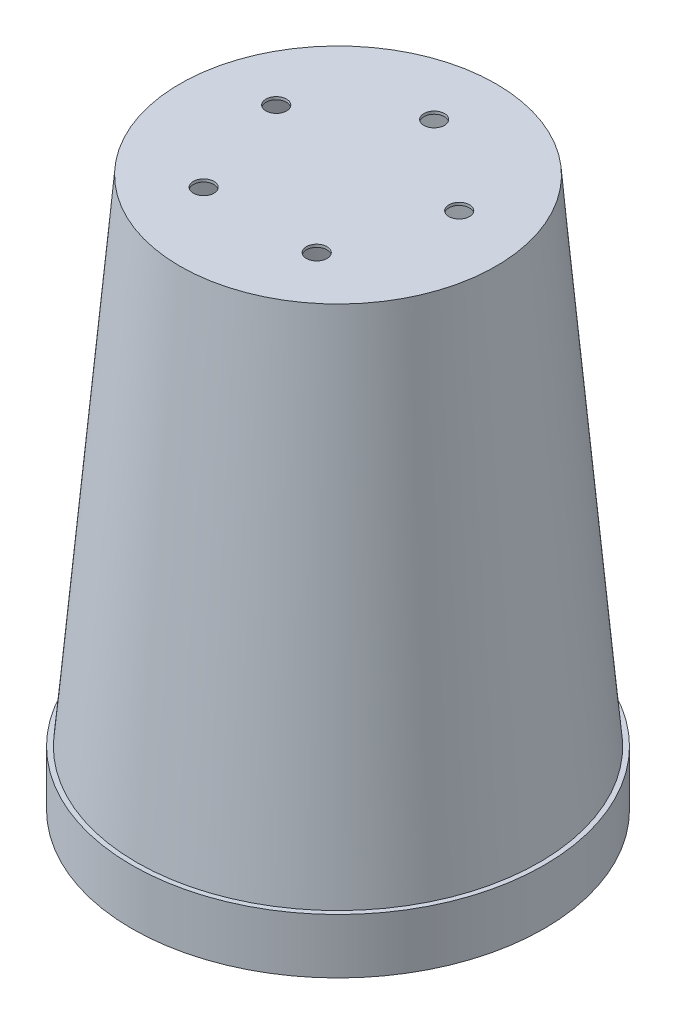
ISO-10303-21;
HEADER;
FILE_DESCRIPTION(('STEP AP214'),'2;1');
FILE_NAME('part.step','',(''),(''),'','','');
FILE_SCHEMA(('AUTOMOTIVE_DESIGN { 1 0 10303 214 1 1 1 1 }'));
ENDSEC;
DATA;
#1=APPLICATION_CONTEXT('core data for automotive mechanical design processes');
#2=APPLICATION_PROTOCOL_DEFINITION('international standard','automotive_design',2000,#1);
#3=PRODUCT_CONTEXT('',#1,'mechanical');
#4=PRODUCT('Part','Part','',(#3));
#5=PRODUCT_RELATED_PRODUCT_CATEGORY('part','',(#4));
#6=PRODUCT_DEFINITION_FORMATION('','',#4);
#7=PRODUCT_DEFINITION_CONTEXT('part definition',#1,'design');
#8=PRODUCT_DEFINITION('design','',#6,#7);
#9=PRODUCT_DEFINITION_SHAPE('','',#8);
#10=(LENGTH_UNIT() NAMED_UNIT(*) SI_UNIT(.MILLI.,.METRE.));
#11=(NAMED_UNIT(*) PLANE_ANGLE_UNIT() SI_UNIT($,.RADIAN.));
#12=(NAMED_UNIT(*) SI_UNIT($,.STERADIAN.) SOLID_ANGLE_UNIT());
#13=UNCERTAINTY_MEASURE_WITH_UNIT(LENGTH_MEASURE(1.E-05),#10,'distance_accuracy_value','');
#14=(GEOMETRIC_REPRESENTATION_CONTEXT(3) GLOBAL_UNCERTAINTY_ASSIGNED_CONTEXT((#13)) GLOBAL_UNIT_ASSIGNED_CONTEXT((#10,
#11,#12)) REPRESENTATION_CONTEXT('',''));
#15=CARTESIAN_POINT('',(0.,0.,0.));
#16=DIRECTION('',(0.,0.,1.));
#17=DIRECTION('',(1.,0.,0.));
#18=AXIS2_PLACEMENT_3D('',#15,#16,#17);
#19=CARTESIAN_POINT('',(0.,0.,0.));
#20=DIRECTION('',(0.,-1.,0.));
#21=DIRECTION('',(0.,0.,1.));
#22=AXIS2_PLACEMENT_3D('',#19,#20,#21);
#23=CONICAL_SURFACE('',#22,75.,0.0872664625997167);
#24=CARTESIAN_POINT('',(0.,20.,0.));
#25=DIRECTION('',(0.,1.,0.));
#26=DIRECTION('',(0.,0.,1.));
#27=AXIS2_PLACEMENT_3D('',#24,#25,#26);
#28=CIRCLE('',#27,73.2502267294815);
#29=CARTESIAN_POINT('',(0.,20.,73.2502267294815));
#30=VERTEX_POINT('',#29);
#31=EDGE_CURVE('E34',#30,#30,#28,.T.);
#32=ORIENTED_EDGE('',*,*,#31,.T.);
#33=EDGE_LOOP('',(#32));
#34=FACE_BOUND('',#33,.T.);
#35=CARTESIAN_POINT('',(0.,200.,0.));
#36=DIRECTION('',(0.,1.,0.));
#37=DIRECTION('',(0.,0.,1.));
#38=AXIS2_PLACEMENT_3D('',#35,#36,#37);
#39=CIRCLE('',#38,57.5022672948152);
#40=CARTESIAN_POINT('',(0.,200.,57.5022672948152));
#41=VERTEX_POINT('',#40);
#42=EDGE_CURVE('E10',#41,#41,#39,.T.);
#43=ORIENTED_EDGE('',*,*,#42,.F.);
#44=EDGE_LOOP('',(#43));
#45=FACE_BOUND('',#44,.T.);
#46=ADVANCED_FACE('F31',(#34,#45),#23,.T.);
#47=CARTESIAN_POINT('',(0.,200.,0.));
#48=DIRECTION('',(0.,1.,0.));
#49=DIRECTION('',(0.,0.,1.));
#50=AXIS2_PLACEMENT_3D('',#47,#48,#49);
#51=PLANE('',#50);
#52=CARTESIAN_POINT('',(-20.5724838302364,200.,28.3155948031233));
#53=DIRECTION('',(0.,1.,0.));
#54=DIRECTION('',(0.587785252292469,0.,-0.809016994374951));
#55=AXIS2_PLACEMENT_3D('',#52,#53,#54);
#56=CIRCLE('',#55,3.75);
#57=CARTESIAN_POINT('',(-20.5724838302364,200.,32.0655948031233));
#58=VERTEX_POINT('',#57);
#59=EDGE_CURVE('E82',#58,#58,#56,.T.);
#60=ORIENTED_EDGE('',*,*,#59,.F.);
#61=EDGE_LOOP('',(#60));
#62=FACE_BOUND('',#61,.T.);
#63=CARTESIAN_POINT('',(20.5724838302368,200.,28.315594803123));
#64=DIRECTION('',(0.,1.,0.));
#65=DIRECTION('',(-0.58778525229248,0.,-0.809016994374942));
#66=AXIS2_PLACEMENT_3D('',#63,#64,#65);
#67=CIRCLE('',#66,3.75);
#68=CARTESIAN_POINT('',(20.5724838302368,200.,32.065594803123));
#69=VERTEX_POINT('',#68);
#70=EDGE_CURVE('E75',#69,#69,#67,.T.);
#71=ORIENTED_EDGE('',*,*,#70,.F.);
#72=EDGE_LOOP('',(#71));
#73=FACE_BOUND('',#72,.T.);
#74=CARTESIAN_POINT('',(33.2869780703303,200.,-10.8155948031235));
#75=DIRECTION('',(0.,1.,0.));
#76=DIRECTION('',(-0.95105651629515,0.,0.309016994374958));
#77=AXIS2_PLACEMENT_3D('',#74,#75,#76);
#78=CIRCLE('',#77,3.75);
#79=CARTESIAN_POINT('',(33.2869780703303,200.,-7.06559480312354));
#80=VERTEX_POINT('',#79);
#81=EDGE_CURVE('E76',#80,#80,#78,.T.);
#82=ORIENTED_EDGE('',*,*,#81,.F.);
#83=EDGE_LOOP('',(#82));
#84=FACE_BOUND('',#83,.T.);
#85=CARTESIAN_POINT('',(-33.2869780703304,200.,-10.8155948031231));
#86=DIRECTION('',(0.,1.,0.));
#87=DIRECTION('',(0.951056516295155,0.,0.309016994374945));
#88=AXIS2_PLACEMENT_3D('',#85,#86,#87);
#89=CIRCLE('',#88,3.75);
#90=CARTESIAN_POINT('',(-33.2869780703304,200.,-7.06559480312307));
#91=VERTEX_POINT('',#90);
#92=EDGE_CURVE('E68',#91,#91,#89,.T.);
#93=ORIENTED_EDGE('',*,*,#92,.F.);
#94=EDGE_LOOP('',(#93));
#95=FACE_BOUND('',#94,.T.);
#96=CARTESIAN_POINT('',(0.,200.,-35.));
#97=DIRECTION('',(0.,1.,0.));
#98=DIRECTION('',(0.,0.,1.));
#99=AXIS2_PLACEMENT_3D('',#96,#97,#98);
#100=CIRCLE('',#99,3.75);
#101=CARTESIAN_POINT('',(0.,200.,-31.25));
#102=VERTEX_POINT('',#101);
#103=EDGE_CURVE('E62',#102,#102,#100,.T.);
#104=ORIENTED_EDGE('',*,*,#103,.F.);
#105=EDGE_LOOP('',(#104));
#106=FACE_BOUND('',#105,.T.);
#107=ORIENTED_EDGE('',*,*,#42,.T.);
#108=EDGE_LOOP('',(#107));
#109=FACE_BOUND('',#108,.T.);
#110=ADVANCED_FACE('F93',(#62,#73,#84,#95,#106,#109),#51,.T.);
#111=CARTESIAN_POINT('',(0.,20.,0.));
#112=DIRECTION('',(0.,-1.,0.));
#113=DIRECTION('',(0.,0.,-1.));
#114=AXIS2_PLACEMENT_3D('',#111,#112,#113);
#115=CYLINDRICAL_SURFACE('',#114,75.);
#116=CARTESIAN_POINT('',(0.,20.,0.));
#117=DIRECTION('',(0.,1.,0.));
#118=DIRECTION('',(0.,0.,1.));
#119=AXIS2_PLACEMENT_3D('',#116,#117,#118);
#120=CIRCLE('',#119,75.);
#121=CARTESIAN_POINT('',(0.,20.,75.));
#122=VERTEX_POINT('',#121);
#123=EDGE_CURVE('E44',#122,#122,#120,.T.);
#124=ORIENTED_EDGE('',*,*,#123,.F.);
#125=EDGE_LOOP('',(#124));
#126=FACE_BOUND('',#125,.T.);
#127=CARTESIAN_POINT('',(0.,0.,0.));
#128=DIRECTION('',(0.,1.,0.));
#129=DIRECTION('',(0.,0.,1.));
#130=AXIS2_PLACEMENT_3D('',#127,#128,#129);
#131=CIRCLE('',#130,75.);
#132=CARTESIAN_POINT('',(0.,0.,75.));
#133=VERTEX_POINT('',#132);
#134=EDGE_CURVE('E38',#133,#133,#131,.T.);
#135=ORIENTED_EDGE('',*,*,#134,.T.);
#136=EDGE_LOOP('',(#135));
#137=FACE_BOUND('',#136,.T.);
#138=ADVANCED_FACE('F96',(#126,#137),#115,.T.);
#139=CARTESIAN_POINT('',(0.,20.,0.));
#140=DIRECTION('',(0.,1.,0.));
#141=DIRECTION('',(0.,0.,1.));
#142=AXIS2_PLACEMENT_3D('',#139,#140,#141);
#143=PLANE('',#142);
#144=ORIENTED_EDGE('',*,*,#31,.F.);
#145=EDGE_LOOP('',(#144));
#146=FACE_BOUND('',#145,.T.);
#147=ORIENTED_EDGE('',*,*,#123,.T.);
#148=EDGE_LOOP('',(#147));
#149=FACE_BOUND('',#148,.T.);
#150=ADVANCED_FACE('F130',(#146,#149),#143,.T.);
#151=CARTESIAN_POINT('',(0.,0.,0.));
#152=DIRECTION('',(0.,1.,0.));
#153=DIRECTION('',(0.,0.,1.));
#154=AXIS2_PLACEMENT_3D('',#151,#152,#153);
#155=PLANE('',#154);
#156=CARTESIAN_POINT('',(0.,0.,0.));
#157=DIRECTION('',(0.,1.,0.));
#158=DIRECTION('',(0.,0.,1.));
#159=AXIS2_PLACEMENT_3D('',#156,#157,#158);
#160=CIRCLE('',#159,74.);
#161=CARTESIAN_POINT('',(0.,0.,74.));
#162=VERTEX_POINT('',#161);
#163=EDGE_CURVE('E48',#162,#162,#160,.T.);
#164=ORIENTED_EDGE('',*,*,#163,.T.);
#165=EDGE_LOOP('',(#164));
#166=FACE_BOUND('',#165,.T.);
#167=ORIENTED_EDGE('',*,*,#134,.F.);
#168=EDGE_LOOP('',(#167));
#169=FACE_BOUND('',#168,.T.);
#170=ADVANCED_FACE('F124',(#166,#169),#155,.F.);
#171=CARTESIAN_POINT('',(0.,-0.0871557427476584,0.));
#172=DIRECTION('',(0.,-1.,0.));
#173=DIRECTION('',(0.,0.,1.));
#174=AXIS2_PLACEMENT_3D('',#171,#172,#173);
#175=CONICAL_SURFACE('',#174,74.0038053019083,0.0872664625997167);
#176=CARTESIAN_POINT('',(0.,19.,0.));
#177=DIRECTION('',(0.,1.,0.));
#178=DIRECTION('',(0.,0.,1.));
#179=AXIS2_PLACEMENT_3D('',#176,#177,#178);
#180=CIRCLE('',#179,72.3338955554641);
#181=CARTESIAN_POINT('',(0.,19.,72.3338955554641));
#182=VERTEX_POINT('',#181);
#183=EDGE_CURVE('E51',#182,#182,#180,.T.);
#184=ORIENTED_EDGE('',*,*,#183,.F.);
#185=EDGE_LOOP('',(#184));
#186=FACE_BOUND('',#185,.T.);
#187=CARTESIAN_POINT('',(0.,199.,0.));
#188=DIRECTION('',(0.,1.,0.));
#189=DIRECTION('',(0.,0.,1.));
#190=AXIS2_PLACEMENT_3D('',#187,#188,#189);
#191=CIRCLE('',#190,56.5859361207977);
#192=CARTESIAN_POINT('',(0.,199.,56.5859361207977));
#193=VERTEX_POINT('',#192);
#194=EDGE_CURVE('E47',#193,#193,#191,.T.);
#195=ORIENTED_EDGE('',*,*,#194,.T.);
#196=EDGE_LOOP('',(#195));
#197=FACE_BOUND('',#196,.T.);
#198=ADVANCED_FACE('F118',(#186,#197),#175,.F.);
#199=CARTESIAN_POINT('',(0.,199.,0.));
#200=DIRECTION('',(0.,1.,0.));
#201=DIRECTION('',(0.,0.,1.));
#202=AXIS2_PLACEMENT_3D('',#199,#200,#201);
#203=PLANE('',#202);
#204=CARTESIAN_POINT('',(-20.5724838302364,199.,28.3155948031233));
#205=DIRECTION('',(0.,1.,0.));
#206=DIRECTION('',(0.,0.,1.));
#207=AXIS2_PLACEMENT_3D('',#204,#205,#206);
#208=CIRCLE('',#207,3.75);
#209=CARTESIAN_POINT('',(-20.5724838302364,199.,32.0655948031233));
#210=VERTEX_POINT('',#209);
#211=EDGE_CURVE('E71',#210,#210,#208,.F.);
#212=ORIENTED_EDGE('',*,*,#211,.F.);
#213=EDGE_LOOP('',(#212));
#214=FACE_BOUND('',#213,.T.);
#215=CARTESIAN_POINT('',(20.5724838302368,199.,28.315594803123));
#216=DIRECTION('',(0.,1.,0.));
#217=DIRECTION('',(0.,0.,1.));
#218=AXIS2_PLACEMENT_3D('',#215,#216,#217);
#219=CIRCLE('',#218,3.75);
#220=CARTESIAN_POINT('',(20.5724838302368,199.,32.065594803123));
#221=VERTEX_POINT('',#220);
#222=EDGE_CURVE('E79',#221,#221,#219,.F.);
#223=ORIENTED_EDGE('',*,*,#222,.F.);
#224=EDGE_LOOP('',(#223));
#225=FACE_BOUND('',#224,.T.);
#226=CARTESIAN_POINT('',(33.2869780703303,199.,-10.8155948031235));
#227=DIRECTION('',(0.,1.,0.));
#228=DIRECTION('',(0.,0.,1.));
#229=AXIS2_PLACEMENT_3D('',#226,#227,#228);
#230=CIRCLE('',#229,3.75);
#231=CARTESIAN_POINT('',(33.2869780703303,199.,-7.06559480312354));
#232=VERTEX_POINT('',#231);
#233=EDGE_CURVE('E72',#232,#232,#230,.F.);
#234=ORIENTED_EDGE('',*,*,#233,.F.);
#235=EDGE_LOOP('',(#234));
#236=FACE_BOUND('',#235,.T.);
#237=CARTESIAN_POINT('',(-33.2869780703304,199.,-10.8155948031231));
#238=DIRECTION('',(0.,1.,0.));
#239=DIRECTION('',(0.,0.,1.));
#240=AXIS2_PLACEMENT_3D('',#237,#238,#239);
#241=CIRCLE('',#240,3.75);
#242=CARTESIAN_POINT('',(-33.2869780703304,199.,-7.06559480312307));
#243=VERTEX_POINT('',#242);
#244=EDGE_CURVE('E65',#243,#243,#241,.F.);
#245=ORIENTED_EDGE('',*,*,#244,.F.);
#246=EDGE_LOOP('',(#245));
#247=FACE_BOUND('',#246,.T.);
#248=CARTESIAN_POINT('',(0.,199.,-35.));
#249=DIRECTION('',(0.,1.,0.));
#250=DIRECTION('',(0.,0.,1.));
#251=AXIS2_PLACEMENT_3D('',#248,#249,#250);
#252=CIRCLE('',#251,3.75);
#253=CARTESIAN_POINT('',(0.,199.,-31.25));
#254=VERTEX_POINT('',#253);
#255=EDGE_CURVE('E55',#254,#254,#252,.F.);
#256=ORIENTED_EDGE('',*,*,#255,.F.);
#257=EDGE_LOOP('',(#256));
#258=FACE_BOUND('',#257,.T.);
#259=ORIENTED_EDGE('',*,*,#194,.F.);
#260=EDGE_LOOP('',(#259));
#261=FACE_BOUND('',#260,.T.);
#262=ADVANCED_FACE('F114',(#214,#225,#236,#247,#258,#261),#203,.F.);
#263=CARTESIAN_POINT('',(0.,20.,0.));
#264=DIRECTION('',(0.,-1.,0.));
#265=DIRECTION('',(0.,0.,-1.));
#266=AXIS2_PLACEMENT_3D('',#263,#264,#265);
#267=CYLINDRICAL_SURFACE('',#266,74.);
#268=CARTESIAN_POINT('',(0.,19.,0.));
#269=DIRECTION('',(0.,1.,0.));
#270=DIRECTION('',(0.,0.,1.));
#271=AXIS2_PLACEMENT_3D('',#268,#269,#270);
#272=CIRCLE('',#271,74.);
#273=CARTESIAN_POINT('',(0.,19.,74.));
#274=VERTEX_POINT('',#273);
#275=EDGE_CURVE('E52',#274,#274,#272,.T.);
#276=ORIENTED_EDGE('',*,*,#275,.T.);
#277=EDGE_LOOP('',(#276));
#278=FACE_BOUND('',#277,.T.);
#279=ORIENTED_EDGE('',*,*,#163,.F.);
#280=EDGE_LOOP('',(#279));
#281=FACE_BOUND('',#280,.T.);
#282=ADVANCED_FACE('F117',(#278,#281),#267,.F.);
#283=CARTESIAN_POINT('',(0.,19.,0.));
#284=DIRECTION('',(0.,1.,0.));
#285=DIRECTION('',(0.,0.,1.));
#286=AXIS2_PLACEMENT_3D('',#283,#284,#285);
#287=PLANE('',#286);
#288=ORIENTED_EDGE('',*,*,#183,.T.);
#289=EDGE_LOOP('',(#288));
#290=FACE_BOUND('',#289,.T.);
#291=ORIENTED_EDGE('',*,*,#275,.F.);
#292=EDGE_LOOP('',(#291));
#293=FACE_BOUND('',#292,.T.);
#294=ADVANCED_FACE('F110',(#290,#293),#287,.F.);
#295=CARTESIAN_POINT('',(0.,-0.001000000000001,-35.));
#296=DIRECTION('',(0.,1.,0.));
#297=DIRECTION('',(0.,0.,1.));
#298=AXIS2_PLACEMENT_3D('',#295,#296,#297);
#299=CYLINDRICAL_SURFACE('',#298,3.75);
#300=CARTESIAN_POINT('',(0.,200.,-31.25));
#301=CARTESIAN_POINT('',(0.,199.989583333333,-31.25));
#302=CARTESIAN_POINT('',(0.,199.979166666667,-31.25));
#303=CARTESIAN_POINT('',(0.,199.958333333333,-31.25));
#304=CARTESIAN_POINT('',(0.,199.947916666667,-31.25));
#305=CARTESIAN_POINT('',(0.,199.927083333333,-31.25));
#306=CARTESIAN_POINT('',(0.,199.916666666667,-31.25));
#307=CARTESIAN_POINT('',(0.,199.895833333333,-31.25));
#308=CARTESIAN_POINT('',(0.,199.885416666667,-31.25));
#309=CARTESIAN_POINT('',(0.,199.864583333333,-31.25));
#310=CARTESIAN_POINT('',(0.,199.854166666667,-31.25));
#311=CARTESIAN_POINT('',(0.,199.833333333333,-31.25));
#312=CARTESIAN_POINT('',(0.,199.822916666667,-31.25));
#313=CARTESIAN_POINT('',(0.,199.802083333333,-31.25));
#314=CARTESIAN_POINT('',(0.,199.791666666667,-31.25));
#315=CARTESIAN_POINT('',(0.,199.770833333333,-31.25));
#316=CARTESIAN_POINT('',(0.,199.760416666667,-31.25));
#317=CARTESIAN_POINT('',(0.,199.739583333333,-31.25));
#318=CARTESIAN_POINT('',(0.,199.729166666667,-31.25));
#319=CARTESIAN_POINT('',(0.,199.708333333333,-31.25));
#320=CARTESIAN_POINT('',(0.,199.697916666667,-31.25));
#321=CARTESIAN_POINT('',(0.,199.677083333333,-31.25));
#322=CARTESIAN_POINT('',(0.,199.666666666667,-31.25));
#323=CARTESIAN_POINT('',(0.,199.645833333333,-31.25));
#324=CARTESIAN_POINT('',(0.,199.635416666667,-31.25));
#325=CARTESIAN_POINT('',(0.,199.614583333333,-31.25));
#326=CARTESIAN_POINT('',(0.,199.604166666667,-31.25));
#327=CARTESIAN_POINT('',(0.,199.583333333333,-31.25));
#328=CARTESIAN_POINT('',(0.,199.572916666667,-31.25));
#329=CARTESIAN_POINT('',(0.,199.552083333333,-31.25));
#330=CARTESIAN_POINT('',(0.,199.541666666667,-31.25));
#331=CARTESIAN_POINT('',(0.,199.520833333333,-31.25));
#332=CARTESIAN_POINT('',(0.,199.510416666667,-31.25));
#333=CARTESIAN_POINT('',(0.,199.489583333333,-31.25));
#334=CARTESIAN_POINT('',(0.,199.479166666667,-31.25));
#335=CARTESIAN_POINT('',(0.,199.458333333333,-31.25));
#336=CARTESIAN_POINT('',(0.,199.447916666667,-31.25));
#337=CARTESIAN_POINT('',(0.,199.427083333333,-31.25));
#338=CARTESIAN_POINT('',(0.,199.416666666667,-31.25));
#339=CARTESIAN_POINT('',(0.,199.395833333333,-31.25));
#340=CARTESIAN_POINT('',(0.,199.385416666667,-31.25));
#341=CARTESIAN_POINT('',(0.,199.364583333333,-31.25));
#342=CARTESIAN_POINT('',(0.,199.354166666667,-31.25));
#343=CARTESIAN_POINT('',(0.,199.333333333333,-31.25));
#344=CARTESIAN_POINT('',(0.,199.322916666667,-31.25));
#345=CARTESIAN_POINT('',(0.,199.302083333333,-31.25));
#346=CARTESIAN_POINT('',(0.,199.291666666667,-31.25));
#347=CARTESIAN_POINT('',(0.,199.270833333333,-31.25));
#348=CARTESIAN_POINT('',(0.,199.260416666667,-31.25));
#349=CARTESIAN_POINT('',(0.,199.239583333333,-31.25));
#350=CARTESIAN_POINT('',(0.,199.229166666667,-31.25));
#351=CARTESIAN_POINT('',(0.,199.208333333333,-31.25));
#352=CARTESIAN_POINT('',(0.,199.197916666667,-31.25));
#353=CARTESIAN_POINT('',(0.,199.177083333333,-31.25));
#354=CARTESIAN_POINT('',(0.,199.166666666667,-31.25));
#355=CARTESIAN_POINT('',(0.,199.145833333333,-31.25));
#356=CARTESIAN_POINT('',(0.,199.135416666667,-31.25));
#357=CARTESIAN_POINT('',(0.,199.114583333333,-31.25));
#358=CARTESIAN_POINT('',(0.,199.104166666667,-31.25));
#359=CARTESIAN_POINT('',(0.,199.083333333333,-31.25));
#360=CARTESIAN_POINT('',(0.,199.072916666667,-31.25));
#361=CARTESIAN_POINT('',(0.,199.052083333333,-31.25));
#362=CARTESIAN_POINT('',(0.,199.041666666667,-31.25));
#363=CARTESIAN_POINT('',(0.,199.020833333333,-31.25));
#364=CARTESIAN_POINT('',(0.,199.010416666667,-31.25));
#365=CARTESIAN_POINT('',(0.,199.,-31.25));
#366=B_SPLINE_CURVE_WITH_KNOTS('',3,(#300,#301,#302,#303,#304,#305,#306,#307,#308,#309,#310,
#311,#312,#313,#314,#315,#316,#317,#318,#319,#320,#321,#322,#323,#324,#325,#326,#327,#328,#329,
#330,#331,#332,#333,#334,#335,#336,#337,#338,#339,#340,#341,#342,#343,#344,#345,#346,#347,#348,
#349,#350,#351,#352,#353,#354,#355,#356,#357,#358,#359,#360,#361,#362,#363,#364,#365),
.UNSPECIFIED.,.F.,.F.,(4,2,2,2,2,2,2,2,2,2,2,2,2,2,2,2,2,2,2,2,2,2,2,2,2,2,2,2,2,2,2,2,4),(0.,
0.0312500000000104,0.0624999999999931,0.0937500000000036,0.124999999999986,0.156249999999997,
0.187500000000007,0.21874999999999,0.25,0.281250000000011,0.312499999999993,0.343750000000004,
0.375000000000014,0.406249999999997,0.437500000000007,0.46874999999999,0.5,0.531250000000011,
0.562499999999994,0.593750000000004,0.624999999999987,0.656249999999997,0.687500000000008,
0.71874999999999,0.750000000000001,0.781250000000011,0.812499999999994,0.843750000000004,
0.875000000000015,0.906249999999997,0.937500000000008,0.96874999999999,1.),.UNSPECIFIED.);
#367=EDGE_CURVE('BSEAM106',#102,#254,#366,.T.);
#368=ORIENTED_EDGE('',*,*,#103,.T.);
#369=ORIENTED_EDGE('',*,*,#255,.T.);
#370=ORIENTED_EDGE('',*,*,#367,.T.);
#371=ORIENTED_EDGE('',*,*,#367,.F.);
#372=EDGE_LOOP('',(#368,#370,#369,#371));
#373=FACE_BOUND('',#372,.T.);
#374=ADVANCED_FACE('F106',(#373),#299,.F.);
#375=CARTESIAN_POINT('',(-33.2869780703304,-0.001000000000001,-10.8155948031231));
#376=DIRECTION('',(0.,1.,0.));
#377=DIRECTION('',(0.,0.,1.));
#378=AXIS2_PLACEMENT_3D('',#375,#376,#377);
#379=CYLINDRICAL_SURFACE('',#378,3.75);
#380=CARTESIAN_POINT('',(-33.2869780703304,200.,-7.06559480312307));
#381=CARTESIAN_POINT('',(-33.2869780703304,199.989583333333,-7.06559480312307));
#382=CARTESIAN_POINT('',(-33.2869780703304,199.979166666667,-7.06559480312307));
#383=CARTESIAN_POINT('',(-33.2869780703304,199.958333333333,-7.06559480312307));
#384=CARTESIAN_POINT('',(-33.2869780703304,199.947916666667,-7.06559480312307));
#385=CARTESIAN_POINT('',(-33.2869780703304,199.927083333333,-7.06559480312307));
#386=CARTESIAN_POINT('',(-33.2869780703304,199.916666666667,-7.06559480312307));
#387=CARTESIAN_POINT('',(-33.2869780703304,199.895833333333,-7.06559480312307));
#388=CARTESIAN_POINT('',(-33.2869780703304,199.885416666667,-7.06559480312307));
#389=CARTESIAN_POINT('',(-33.2869780703304,199.864583333333,-7.06559480312307));
#390=CARTESIAN_POINT('',(-33.2869780703304,199.854166666667,-7.06559480312307));
#391=CARTESIAN_POINT('',(-33.2869780703304,199.833333333333,-7.06559480312307));
#392=CARTESIAN_POINT('',(-33.2869780703304,199.822916666667,-7.06559480312307));
#393=CARTESIAN_POINT('',(-33.2869780703304,199.802083333333,-7.06559480312307));
#394=CARTESIAN_POINT('',(-33.2869780703304,199.791666666667,-7.06559480312307));
#395=CARTESIAN_POINT('',(-33.2869780703304,199.770833333333,-7.06559480312307));
#396=CARTESIAN_POINT('',(-33.2869780703304,199.760416666667,-7.06559480312307));
#397=CARTESIAN_POINT('',(-33.2869780703304,199.739583333333,-7.06559480312307));
#398=CARTESIAN_POINT('',(-33.2869780703304,199.729166666667,-7.06559480312307));
#399=CARTESIAN_POINT('',(-33.2869780703304,199.708333333333,-7.06559480312307));
#400=CARTESIAN_POINT('',(-33.2869780703304,199.697916666667,-7.06559480312307));
#401=CARTESIAN_POINT('',(-33.2869780703304,199.677083333333,-7.06559480312307));
#402=CARTESIAN_POINT('',(-33.2869780703304,199.666666666667,-7.06559480312307));
#403=CARTESIAN_POINT('',(-33.2869780703304,199.645833333333,-7.06559480312307));
#404=CARTESIAN_POINT('',(-33.2869780703304,199.635416666667,-7.06559480312307));
#405=CARTESIAN_POINT('',(-33.2869780703304,199.614583333333,-7.06559480312307));
#406=CARTESIAN_POINT('',(-33.2869780703304,199.604166666667,-7.06559480312307));
#407=CARTESIAN_POINT('',(-33.2869780703304,199.583333333333,-7.06559480312307));
#408=CARTESIAN_POINT('',(-33.2869780703304,199.572916666667,-7.06559480312307));
#409=CARTESIAN_POINT('',(-33.2869780703304,199.552083333333,-7.06559480312307));
#410=CARTESIAN_POINT('',(-33.2869780703304,199.541666666667,-7.06559480312307));
#411=CARTESIAN_POINT('',(-33.2869780703304,199.520833333333,-7.06559480312307));
#412=CARTESIAN_POINT('',(-33.2869780703304,199.510416666667,-7.06559480312307));
#413=CARTESIAN_POINT('',(-33.2869780703304,199.489583333333,-7.06559480312307));
#414=CARTESIAN_POINT('',(-33.2869780703304,199.479166666667,-7.06559480312307));
#415=CARTESIAN_POINT('',(-33.2869780703304,199.458333333333,-7.06559480312307));
#416=CARTESIAN_POINT('',(-33.2869780703304,199.447916666667,-7.06559480312307));
#417=CARTESIAN_POINT('',(-33.2869780703304,199.427083333333,-7.06559480312307));
#418=CARTESIAN_POINT('',(-33.2869780703304,199.416666666667,-7.06559480312307));
#419=CARTESIAN_POINT('',(-33.2869780703304,199.395833333333,-7.06559480312307));
#420=CARTESIAN_POINT('',(-33.2869780703304,199.385416666667,-7.06559480312307));
#421=CARTESIAN_POINT('',(-33.2869780703304,199.364583333333,-7.06559480312307));
#422=CARTESIAN_POINT('',(-33.2869780703304,199.354166666667,-7.06559480312307));
#423=CARTESIAN_POINT('',(-33.2869780703304,199.333333333333,-7.06559480312307));
#424=CARTESIAN_POINT('',(-33.2869780703304,199.322916666667,-7.06559480312307));
#425=CARTESIAN_POINT('',(-33.2869780703304,199.302083333333,-7.06559480312307));
#426=CARTESIAN_POINT('',(-33.2869780703304,199.291666666667,-7.06559480312307));
#427=CARTESIAN_POINT('',(-33.2869780703304,199.270833333333,-7.06559480312307));
#428=CARTESIAN_POINT('',(-33.2869780703304,199.260416666667,-7.06559480312307));
#429=CARTESIAN_POINT('',(-33.2869780703304,199.239583333333,-7.06559480312307));
#430=CARTESIAN_POINT('',(-33.2869780703304,199.229166666667,-7.06559480312307));
#431=CARTESIAN_POINT('',(-33.2869780703304,199.208333333333,-7.06559480312307));
#432=CARTESIAN_POINT('',(-33.2869780703304,199.197916666667,-7.06559480312307));
#433=CARTESIAN_POINT('',(-33.2869780703304,199.177083333333,-7.06559480312307));
#434=CARTESIAN_POINT('',(-33.2869780703304,199.166666666667,-7.06559480312307));
#435=CARTESIAN_POINT('',(-33.2869780703304,199.145833333333,-7.06559480312307));
#436=CARTESIAN_POINT('',(-33.2869780703304,199.135416666667,-7.06559480312307));
#437=CARTESIAN_POINT('',(-33.2869780703304,199.114583333333,-7.06559480312307));
#438=CARTESIAN_POINT('',(-33.2869780703304,199.104166666667,-7.06559480312307));
#439=CARTESIAN_POINT('',(-33.2869780703304,199.083333333333,-7.06559480312307));
#440=CARTESIAN_POINT('',(-33.2869780703304,199.072916666667,-7.06559480312307));
#441=CARTESIAN_POINT('',(-33.2869780703304,199.052083333333,-7.06559480312307));
#442=CARTESIAN_POINT('',(-33.2869780703304,199.041666666667,-7.06559480312307));
#443=CARTESIAN_POINT('',(-33.2869780703304,199.020833333333,-7.06559480312307));
#444=CARTESIAN_POINT('',(-33.2869780703304,199.010416666667,-7.06559480312307));
#445=CARTESIAN_POINT('',(-33.2869780703304,199.,-7.06559480312307));
#446=B_SPLINE_CURVE_WITH_KNOTS('',3,(#380,#381,#382,#383,#384,#385,#386,#387,#388,#389,#390,
#391,#392,#393,#394,#395,#396,#397,#398,#399,#400,#401,#402,#403,#404,#405,#406,#407,#408,#409,
#410,#411,#412,#413,#414,#415,#416,#417,#418,#419,#420,#421,#422,#423,#424,#425,#426,#427,#428,
#429,#430,#431,#432,#433,#434,#435,#436,#437,#438,#439,#440,#441,#442,#443,#444,#445),
.UNSPECIFIED.,.F.,.F.,(4,2,2,2,2,2,2,2,2,2,2,2,2,2,2,2,2,2,2,2,2,2,2,2,2,2,2,2,2,2,2,2,4),(0.,
0.0312500000000104,0.0624999999999931,0.0937500000000036,0.124999999999986,0.156249999999997,
0.187500000000007,0.21874999999999,0.25,0.281250000000011,0.312499999999993,0.343750000000004,
0.375000000000014,0.406249999999997,0.437500000000007,0.46874999999999,0.5,0.531250000000011,
0.562499999999994,0.593750000000004,0.624999999999987,0.656249999999997,0.687500000000008,
0.71874999999999,0.750000000000001,0.781250000000011,0.812499999999994,0.843750000000004,
0.875000000000015,0.906249999999997,0.937500000000008,0.96874999999999,1.),.UNSPECIFIED.);
#447=EDGE_CURVE('BSEAM109',#91,#243,#446,.T.);
#448=ORIENTED_EDGE('',*,*,#92,.T.);
#449=ORIENTED_EDGE('',*,*,#244,.T.);
#450=ORIENTED_EDGE('',*,*,#447,.T.);
#451=ORIENTED_EDGE('',*,*,#447,.F.);
#452=EDGE_LOOP('',(#448,#450,#449,#451));
#453=FACE_BOUND('',#452,.T.);
#454=ADVANCED_FACE('F109',(#453),#379,.F.);
#455=CARTESIAN_POINT('',(33.2869780703303,-0.001000000000001,-10.8155948031235));
#456=DIRECTION('',(0.,1.,0.));
#457=DIRECTION('',(0.,0.,1.));
#458=AXIS2_PLACEMENT_3D('',#455,#456,#457);
#459=CYLINDRICAL_SURFACE('',#458,3.75);
#460=CARTESIAN_POINT('',(33.2869780703303,200.,-7.06559480312354));
#461=CARTESIAN_POINT('',(33.2869780703303,199.989583333333,-7.06559480312354));
#462=CARTESIAN_POINT('',(33.2869780703303,199.979166666667,-7.06559480312354));
#463=CARTESIAN_POINT('',(33.2869780703303,199.958333333333,-7.06559480312354));
#464=CARTESIAN_POINT('',(33.2869780703303,199.947916666667,-7.06559480312354));
#465=CARTESIAN_POINT('',(33.2869780703303,199.927083333333,-7.06559480312354));
#466=CARTESIAN_POINT('',(33.2869780703303,199.916666666667,-7.06559480312354));
#467=CARTESIAN_POINT('',(33.2869780703303,199.895833333333,-7.06559480312354));
#468=CARTESIAN_POINT('',(33.2869780703303,199.885416666667,-7.06559480312354));
#469=CARTESIAN_POINT('',(33.2869780703303,199.864583333333,-7.06559480312354));
#470=CARTESIAN_POINT('',(33.2869780703303,199.854166666667,-7.06559480312354));
#471=CARTESIAN_POINT('',(33.2869780703303,199.833333333333,-7.06559480312354));
#472=CARTESIAN_POINT('',(33.2869780703303,199.822916666667,-7.06559480312354));
#473=CARTESIAN_POINT('',(33.2869780703303,199.802083333333,-7.06559480312354));
#474=CARTESIAN_POINT('',(33.2869780703303,199.791666666667,-7.06559480312354));
#475=CARTESIAN_POINT('',(33.2869780703303,199.770833333333,-7.06559480312354));
#476=CARTESIAN_POINT('',(33.2869780703303,199.760416666667,-7.06559480312354));
#477=CARTESIAN_POINT('',(33.2869780703303,199.739583333333,-7.06559480312354));
#478=CARTESIAN_POINT('',(33.2869780703303,199.729166666667,-7.06559480312354));
#479=CARTESIAN_POINT('',(33.2869780703303,199.708333333333,-7.06559480312354));
#480=CARTESIAN_POINT('',(33.2869780703303,199.697916666667,-7.06559480312354));
#481=CARTESIAN_POINT('',(33.2869780703303,199.677083333333,-7.06559480312354));
#482=CARTESIAN_POINT('',(33.2869780703303,199.666666666667,-7.06559480312354));
#483=CARTESIAN_POINT('',(33.2869780703303,199.645833333333,-7.06559480312354));
#484=CARTESIAN_POINT('',(33.2869780703303,199.635416666667,-7.06559480312354));
#485=CARTESIAN_POINT('',(33.2869780703303,199.614583333333,-7.06559480312354));
#486=CARTESIAN_POINT('',(33.2869780703303,199.604166666667,-7.06559480312354));
#487=CARTESIAN_POINT('',(33.2869780703303,199.583333333333,-7.06559480312354));
#488=CARTESIAN_POINT('',(33.2869780703303,199.572916666667,-7.06559480312354));
#489=CARTESIAN_POINT('',(33.2869780703303,199.552083333333,-7.06559480312354));
#490=CARTESIAN_POINT('',(33.2869780703303,199.541666666667,-7.06559480312354));
#491=CARTESIAN_POINT('',(33.2869780703303,199.520833333333,-7.06559480312354));
#492=CARTESIAN_POINT('',(33.2869780703303,199.510416666667,-7.06559480312354));
#493=CARTESIAN_POINT('',(33.2869780703303,199.489583333333,-7.06559480312354));
#494=CARTESIAN_POINT('',(33.2869780703303,199.479166666667,-7.06559480312354));
#495=CARTESIAN_POINT('',(33.2869780703303,199.458333333333,-7.06559480312354));
#496=CARTESIAN_POINT('',(33.2869780703303,199.447916666667,-7.06559480312354));
#497=CARTESIAN_POINT('',(33.2869780703303,199.427083333333,-7.06559480312354));
#498=CARTESIAN_POINT('',(33.2869780703303,199.416666666667,-7.06559480312354));
#499=CARTESIAN_POINT('',(33.2869780703303,199.395833333333,-7.06559480312354));
#500=CARTESIAN_POINT('',(33.2869780703303,199.385416666667,-7.06559480312354));
#501=CARTESIAN_POINT('',(33.2869780703303,199.364583333333,-7.06559480312354));
#502=CARTESIAN_POINT('',(33.2869780703303,199.354166666667,-7.06559480312354));
#503=CARTESIAN_POINT('',(33.2869780703303,199.333333333333,-7.06559480312354));
#504=CARTESIAN_POINT('',(33.2869780703303,199.322916666667,-7.06559480312354));
#505=CARTESIAN_POINT('',(33.2869780703303,199.302083333333,-7.06559480312354));
#506=CARTESIAN_POINT('',(33.2869780703303,199.291666666667,-7.06559480312354));
#507=CARTESIAN_POINT('',(33.2869780703303,199.270833333333,-7.06559480312354));
#508=CARTESIAN_POINT('',(33.2869780703303,199.260416666667,-7.06559480312354));
#509=CARTESIAN_POINT('',(33.2869780703303,199.239583333333,-7.06559480312354));
#510=CARTESIAN_POINT('',(33.2869780703303,199.229166666667,-7.06559480312354));
#511=CARTESIAN_POINT('',(33.2869780703303,199.208333333333,-7.06559480312354));
#512=CARTESIAN_POINT('',(33.2869780703303,199.197916666667,-7.06559480312354));
#513=CARTESIAN_POINT('',(33.2869780703303,199.177083333333,-7.06559480312354));
#514=CARTESIAN_POINT('',(33.2869780703303,199.166666666667,-7.06559480312354));
#515=CARTESIAN_POINT('',(33.2869780703303,199.145833333333,-7.06559480312354));
#516=CARTESIAN_POINT('',(33.2869780703303,199.135416666667,-7.06559480312354));
#517=CARTESIAN_POINT('',(33.2869780703303,199.114583333333,-7.06559480312354));
#518=CARTESIAN_POINT('',(33.2869780703303,199.104166666667,-7.06559480312354));
#519=CARTESIAN_POINT('',(33.2869780703303,199.083333333333,-7.06559480312354));
#520=CARTESIAN_POINT('',(33.2869780703303,199.072916666667,-7.06559480312354));
#521=CARTESIAN_POINT('',(33.2869780703303,199.052083333333,-7.06559480312354));
#522=CARTESIAN_POINT('',(33.2869780703303,199.041666666667,-7.06559480312354));
#523=CARTESIAN_POINT('',(33.2869780703303,199.020833333333,-7.06559480312354));
#524=CARTESIAN_POINT('',(33.2869780703303,199.010416666667,-7.06559480312354));
#525=CARTESIAN_POINT('',(33.2869780703303,199.,-7.06559480312354));
#526=B_SPLINE_CURVE_WITH_KNOTS('',3,(#460,#461,#462,#463,#464,#465,#466,#467,#468,#469,#470,
#471,#472,#473,#474,#475,#476,#477,#478,#479,#480,#481,#482,#483,#484,#485,#486,#487,#488,#489,
#490,#491,#492,#493,#494,#495,#496,#497,#498,#499,#500,#501,#502,#503,#504,#505,#506,#507,#508,
#509,#510,#511,#512,#513,#514,#515,#516,#517,#518,#519,#520,#521,#522,#523,#524,#525),
.UNSPECIFIED.,.F.,.F.,(4,2,2,2,2,2,2,2,2,2,2,2,2,2,2,2,2,2,2,2,2,2,2,2,2,2,2,2,2,2,2,2,4),(0.,
0.0312500000000104,0.0624999999999931,0.0937500000000036,0.124999999999986,0.156249999999997,
0.187500000000007,0.21874999999999,0.25,0.281250000000011,0.312499999999993,0.343750000000004,
0.375000000000014,0.406249999999997,0.437500000000007,0.46874999999999,0.5,0.531250000000011,
0.562499999999994,0.593750000000004,0.624999999999987,0.656249999999997,0.687500000000008,
0.71874999999999,0.750000000000001,0.781250000000011,0.812499999999994,0.843750000000004,
0.875000000000015,0.906249999999997,0.937500000000008,0.96874999999999,1.),.UNSPECIFIED.);
#527=EDGE_CURVE('BSEAM182',#80,#232,#526,.T.);
#528=ORIENTED_EDGE('',*,*,#81,.T.);
#529=ORIENTED_EDGE('',*,*,#233,.T.);
#530=ORIENTED_EDGE('',*,*,#527,.T.);
#531=ORIENTED_EDGE('',*,*,#527,.F.);
#532=EDGE_LOOP('',(#528,#530,#529,#531));
#533=FACE_BOUND('',#532,.T.);
#534=ADVANCED_FACE('F182',(#533),#459,.F.);
#535=CARTESIAN_POINT('',(20.5724838302368,-0.001000000000001,28.315594803123));
#536=DIRECTION('',(0.,1.,0.));
#537=DIRECTION('',(0.,0.,1.));
#538=AXIS2_PLACEMENT_3D('',#535,#536,#537);
#539=CYLINDRICAL_SURFACE('',#538,3.75);
#540=CARTESIAN_POINT('',(20.5724838302368,200.,32.065594803123));
#541=CARTESIAN_POINT('',(20.5724838302368,199.989583333333,32.065594803123));
#542=CARTESIAN_POINT('',(20.5724838302368,199.979166666667,32.065594803123));
#543=CARTESIAN_POINT('',(20.5724838302368,199.958333333333,32.065594803123));
#544=CARTESIAN_POINT('',(20.5724838302368,199.947916666667,32.065594803123));
#545=CARTESIAN_POINT('',(20.5724838302368,199.927083333333,32.065594803123));
#546=CARTESIAN_POINT('',(20.5724838302368,199.916666666667,32.065594803123));
#547=CARTESIAN_POINT('',(20.5724838302368,199.895833333333,32.065594803123));
#548=CARTESIAN_POINT('',(20.5724838302368,199.885416666667,32.065594803123));
#549=CARTESIAN_POINT('',(20.5724838302368,199.864583333333,32.065594803123));
#550=CARTESIAN_POINT('',(20.5724838302368,199.854166666667,32.065594803123));
#551=CARTESIAN_POINT('',(20.5724838302368,199.833333333333,32.065594803123));
#552=CARTESIAN_POINT('',(20.5724838302368,199.822916666667,32.065594803123));
#553=CARTESIAN_POINT('',(20.5724838302368,199.802083333333,32.065594803123));
#554=CARTESIAN_POINT('',(20.5724838302368,199.791666666667,32.065594803123));
#555=CARTESIAN_POINT('',(20.5724838302368,199.770833333333,32.065594803123));
#556=CARTESIAN_POINT('',(20.5724838302368,199.760416666667,32.065594803123));
#557=CARTESIAN_POINT('',(20.5724838302368,199.739583333333,32.065594803123));
#558=CARTESIAN_POINT('',(20.5724838302368,199.729166666667,32.065594803123));
#559=CARTESIAN_POINT('',(20.5724838302368,199.708333333333,32.065594803123));
#560=CARTESIAN_POINT('',(20.5724838302368,199.697916666667,32.065594803123));
#561=CARTESIAN_POINT('',(20.5724838302368,199.677083333333,32.065594803123));
#562=CARTESIAN_POINT('',(20.5724838302368,199.666666666667,32.065594803123));
#563=CARTESIAN_POINT('',(20.5724838302368,199.645833333333,32.065594803123));
#564=CARTESIAN_POINT('',(20.5724838302368,199.635416666667,32.065594803123));
#565=CARTESIAN_POINT('',(20.5724838302368,199.614583333333,32.065594803123));
#566=CARTESIAN_POINT('',(20.5724838302368,199.604166666667,32.065594803123));
#567=CARTESIAN_POINT('',(20.5724838302368,199.583333333333,32.065594803123));
#568=CARTESIAN_POINT('',(20.5724838302368,199.572916666667,32.065594803123));
#569=CARTESIAN_POINT('',(20.5724838302368,199.552083333333,32.065594803123));
#570=CARTESIAN_POINT('',(20.5724838302368,199.541666666667,32.065594803123));
#571=CARTESIAN_POINT('',(20.5724838302368,199.520833333333,32.065594803123));
#572=CARTESIAN_POINT('',(20.5724838302368,199.510416666667,32.065594803123));
#573=CARTESIAN_POINT('',(20.5724838302368,199.489583333333,32.065594803123));
#574=CARTESIAN_POINT('',(20.5724838302368,199.479166666667,32.065594803123));
#575=CARTESIAN_POINT('',(20.5724838302368,199.458333333333,32.065594803123));
#576=CARTESIAN_POINT('',(20.5724838302368,199.447916666667,32.065594803123));
#577=CARTESIAN_POINT('',(20.5724838302368,199.427083333333,32.065594803123));
#578=CARTESIAN_POINT('',(20.5724838302368,199.416666666667,32.065594803123));
#579=CARTESIAN_POINT('',(20.5724838302368,199.395833333333,32.065594803123));
#580=CARTESIAN_POINT('',(20.5724838302368,199.385416666667,32.065594803123));
#581=CARTESIAN_POINT('',(20.5724838302368,199.364583333333,32.065594803123));
#582=CARTESIAN_POINT('',(20.5724838302368,199.354166666667,32.065594803123));
#583=CARTESIAN_POINT('',(20.5724838302368,199.333333333333,32.065594803123));
#584=CARTESIAN_POINT('',(20.5724838302368,199.322916666667,32.065594803123));
#585=CARTESIAN_POINT('',(20.5724838302368,199.302083333333,32.065594803123));
#586=CARTESIAN_POINT('',(20.5724838302368,199.291666666667,32.065594803123));
#587=CARTESIAN_POINT('',(20.5724838302368,199.270833333333,32.065594803123));
#588=CARTESIAN_POINT('',(20.5724838302368,199.260416666667,32.065594803123));
#589=CARTESIAN_POINT('',(20.5724838302368,199.239583333333,32.065594803123));
#590=CARTESIAN_POINT('',(20.5724838302368,199.229166666667,32.065594803123));
#591=CARTESIAN_POINT('',(20.5724838302368,199.208333333333,32.065594803123));
#592=CARTESIAN_POINT('',(20.5724838302368,199.197916666667,32.065594803123));
#593=CARTESIAN_POINT('',(20.5724838302368,199.177083333333,32.065594803123));
#594=CARTESIAN_POINT('',(20.5724838302368,199.166666666667,32.065594803123));
#595=CARTESIAN_POINT('',(20.5724838302368,199.145833333333,32.065594803123));
#596=CARTESIAN_POINT('',(20.5724838302368,199.135416666667,32.065594803123));
#597=CARTESIAN_POINT('',(20.5724838302368,199.114583333333,32.065594803123));
#598=CARTESIAN_POINT('',(20.5724838302368,199.104166666667,32.065594803123));
#599=CARTESIAN_POINT('',(20.5724838302368,199.083333333333,32.065594803123));
#600=CARTESIAN_POINT('',(20.5724838302368,199.072916666667,32.065594803123));
#601=CARTESIAN_POINT('',(20.5724838302368,199.052083333333,32.065594803123));
#602=CARTESIAN_POINT('',(20.5724838302368,199.041666666667,32.065594803123));
#603=CARTESIAN_POINT('',(20.5724838302368,199.020833333333,32.065594803123));
#604=CARTESIAN_POINT('',(20.5724838302368,199.010416666667,32.065594803123));
#605=CARTESIAN_POINT('',(20.5724838302368,199.,32.065594803123));
#606=B_SPLINE_CURVE_WITH_KNOTS('',3,(#540,#541,#542,#543,#544,#545,#546,#547,#548,#549,#550,
#551,#552,#553,#554,#555,#556,#557,#558,#559,#560,#561,#562,#563,#564,#565,#566,#567,#568,#569,
#570,#571,#572,#573,#574,#575,#576,#577,#578,#579,#580,#581,#582,#583,#584,#585,#586,#587,#588,
#589,#590,#591,#592,#593,#594,#595,#596,#597,#598,#599,#600,#601,#602,#603,#604,#605),
.UNSPECIFIED.,.F.,.F.,(4,2,2,2,2,2,2,2,2,2,2,2,2,2,2,2,2,2,2,2,2,2,2,2,2,2,2,2,2,2,2,2,4),(0.,
0.0312500000000104,0.0624999999999931,0.0937500000000036,0.124999999999986,0.156249999999997,
0.187500000000007,0.21874999999999,0.25,0.281250000000011,0.312499999999993,0.343750000000004,
0.375000000000014,0.406249999999997,0.437500000000007,0.46874999999999,0.5,0.531250000000011,
0.562499999999994,0.593750000000004,0.624999999999987,0.656249999999997,0.687500000000008,
0.71874999999999,0.750000000000001,0.781250000000011,0.812499999999994,0.843750000000004,
0.875000000000015,0.906249999999997,0.937500000000008,0.96874999999999,1.),.UNSPECIFIED.);
#607=EDGE_CURVE('BSEAM190',#69,#221,#606,.T.);
#608=ORIENTED_EDGE('',*,*,#70,.T.);
#609=ORIENTED_EDGE('',*,*,#222,.T.);
#610=ORIENTED_EDGE('',*,*,#607,.T.);
#611=ORIENTED_EDGE('',*,*,#607,.F.);
#612=EDGE_LOOP('',(#608,#610,#609,#611));
#613=FACE_BOUND('',#612,.T.);
#614=ADVANCED_FACE('F190',(#613),#539,.F.);
#615=CARTESIAN_POINT('',(-20.5724838302364,-0.001000000000001,28.3155948031233));
#616=DIRECTION('',(0.,1.,0.));
#617=DIRECTION('',(0.,0.,1.));
#618=AXIS2_PLACEMENT_3D('',#615,#616,#617);
#619=CYLINDRICAL_SURFACE('',#618,3.75);
#620=CARTESIAN_POINT('',(-20.5724838302364,200.,32.0655948031233));
#621=CARTESIAN_POINT('',(-20.5724838302364,199.989583333333,32.0655948031233));
#622=CARTESIAN_POINT('',(-20.5724838302364,199.979166666667,32.0655948031233));
#623=CARTESIAN_POINT('',(-20.5724838302364,199.958333333333,32.0655948031233));
#624=CARTESIAN_POINT('',(-20.5724838302364,199.947916666667,32.0655948031233));
#625=CARTESIAN_POINT('',(-20.5724838302364,199.927083333333,32.0655948031233));
#626=CARTESIAN_POINT('',(-20.5724838302364,199.916666666667,32.0655948031233));
#627=CARTESIAN_POINT('',(-20.5724838302364,199.895833333333,32.0655948031233));
#628=CARTESIAN_POINT('',(-20.5724838302364,199.885416666667,32.0655948031233));
#629=CARTESIAN_POINT('',(-20.5724838302364,199.864583333333,32.0655948031233));
#630=CARTESIAN_POINT('',(-20.5724838302364,199.854166666667,32.0655948031233));
#631=CARTESIAN_POINT('',(-20.5724838302364,199.833333333333,32.0655948031233));
#632=CARTESIAN_POINT('',(-20.5724838302364,199.822916666667,32.0655948031233));
#633=CARTESIAN_POINT('',(-20.5724838302364,199.802083333333,32.0655948031233));
#634=CARTESIAN_POINT('',(-20.5724838302364,199.791666666667,32.0655948031233));
#635=CARTESIAN_POINT('',(-20.5724838302364,199.770833333333,32.0655948031233));
#636=CARTESIAN_POINT('',(-20.5724838302364,199.760416666667,32.0655948031233));
#637=CARTESIAN_POINT('',(-20.5724838302364,199.739583333333,32.0655948031233));
#638=CARTESIAN_POINT('',(-20.5724838302364,199.729166666667,32.0655948031233));
#639=CARTESIAN_POINT('',(-20.5724838302364,199.708333333333,32.0655948031233));
#640=CARTESIAN_POINT('',(-20.5724838302364,199.697916666667,32.0655948031233));
#641=CARTESIAN_POINT('',(-20.5724838302364,199.677083333333,32.0655948031233));
#642=CARTESIAN_POINT('',(-20.5724838302364,199.666666666667,32.0655948031233));
#643=CARTESIAN_POINT('',(-20.5724838302364,199.645833333333,32.0655948031233));
#644=CARTESIAN_POINT('',(-20.5724838302364,199.635416666667,32.0655948031233));
#645=CARTESIAN_POINT('',(-20.5724838302364,199.614583333333,32.0655948031233));
#646=CARTESIAN_POINT('',(-20.5724838302364,199.604166666667,32.0655948031233));
#647=CARTESIAN_POINT('',(-20.5724838302364,199.583333333333,32.0655948031233));
#648=CARTESIAN_POINT('',(-20.5724838302364,199.572916666667,32.0655948031233));
#649=CARTESIAN_POINT('',(-20.5724838302364,199.552083333333,32.0655948031233));
#650=CARTESIAN_POINT('',(-20.5724838302364,199.541666666667,32.0655948031233));
#651=CARTESIAN_POINT('',(-20.5724838302364,199.520833333333,32.0655948031233));
#652=CARTESIAN_POINT('',(-20.5724838302364,199.510416666667,32.0655948031233));
#653=CARTESIAN_POINT('',(-20.5724838302364,199.489583333333,32.0655948031233));
#654=CARTESIAN_POINT('',(-20.5724838302364,199.479166666667,32.0655948031233));
#655=CARTESIAN_POINT('',(-20.5724838302364,199.458333333333,32.0655948031233));
#656=CARTESIAN_POINT('',(-20.5724838302364,199.447916666667,32.0655948031233));
#657=CARTESIAN_POINT('',(-20.5724838302364,199.427083333333,32.0655948031233));
#658=CARTESIAN_POINT('',(-20.5724838302364,199.416666666667,32.0655948031233));
#659=CARTESIAN_POINT('',(-20.5724838302364,199.395833333333,32.0655948031233));
#660=CARTESIAN_POINT('',(-20.5724838302364,199.385416666667,32.0655948031233));
#661=CARTESIAN_POINT('',(-20.5724838302364,199.364583333333,32.0655948031233));
#662=CARTESIAN_POINT('',(-20.5724838302364,199.354166666667,32.0655948031233));
#663=CARTESIAN_POINT('',(-20.5724838302364,199.333333333333,32.0655948031233));
#664=CARTESIAN_POINT('',(-20.5724838302364,199.322916666667,32.0655948031233));
#665=CARTESIAN_POINT('',(-20.5724838302364,199.302083333333,32.0655948031233));
#666=CARTESIAN_POINT('',(-20.5724838302364,199.291666666667,32.0655948031233));
#667=CARTESIAN_POINT('',(-20.5724838302364,199.270833333333,32.0655948031233));
#668=CARTESIAN_POINT('',(-20.5724838302364,199.260416666667,32.0655948031233));
#669=CARTESIAN_POINT('',(-20.5724838302364,199.239583333333,32.0655948031233));
#670=CARTESIAN_POINT('',(-20.5724838302364,199.229166666667,32.0655948031233));
#671=CARTESIAN_POINT('',(-20.5724838302364,199.208333333333,32.0655948031233));
#672=CARTESIAN_POINT('',(-20.5724838302364,199.197916666667,32.0655948031233));
#673=CARTESIAN_POINT('',(-20.5724838302364,199.177083333333,32.0655948031233));
#674=CARTESIAN_POINT('',(-20.5724838302364,199.166666666667,32.0655948031233));
#675=CARTESIAN_POINT('',(-20.5724838302364,199.145833333333,32.0655948031233));
#676=CARTESIAN_POINT('',(-20.5724838302364,199.135416666667,32.0655948031233));
#677=CARTESIAN_POINT('',(-20.5724838302364,199.114583333333,32.0655948031233));
#678=CARTESIAN_POINT('',(-20.5724838302364,199.104166666667,32.0655948031233));
#679=CARTESIAN_POINT('',(-20.5724838302364,199.083333333333,32.0655948031233));
#680=CARTESIAN_POINT('',(-20.5724838302364,199.072916666667,32.0655948031233));
#681=CARTESIAN_POINT('',(-20.5724838302364,199.052083333333,32.0655948031233));
#682=CARTESIAN_POINT('',(-20.5724838302364,199.041666666667,32.0655948031233));
#683=CARTESIAN_POINT('',(-20.5724838302364,199.020833333333,32.0655948031233));
#684=CARTESIAN_POINT('',(-20.5724838302364,199.010416666667,32.0655948031233));
#685=CARTESIAN_POINT('',(-20.5724838302364,199.,32.0655948031233));
#686=B_SPLINE_CURVE_WITH_KNOTS('',3,(#620,#621,#622,#623,#624,#625,#626,#627,#628,#629,#630,
#631,#632,#633,#634,#635,#636,#637,#638,#639,#640,#641,#642,#643,#644,#645,#646,#647,#648,#649,
#650,#651,#652,#653,#654,#655,#656,#657,#658,#659,#660,#661,#662,#663,#664,#665,#666,#667,#668,
#669,#670,#671,#672,#673,#674,#675,#676,#677,#678,#679,#680,#681,#682,#683,#684,#685),
.UNSPECIFIED.,.F.,.F.,(4,2,2,2,2,2,2,2,2,2,2,2,2,2,2,2,2,2,2,2,2,2,2,2,2,2,2,2,2,2,2,2,4),(0.,
0.0312500000000104,0.0624999999999931,0.0937500000000036,0.124999999999986,0.156249999999997,
0.187500000000007,0.21874999999999,0.25,0.281250000000011,0.312499999999993,0.343750000000004,
0.375000000000014,0.406249999999997,0.437500000000007,0.46874999999999,0.5,0.531250000000011,
0.562499999999994,0.593750000000004,0.624999999999987,0.656249999999997,0.687500000000008,
0.71874999999999,0.750000000000001,0.781250000000011,0.812499999999994,0.843750000000004,
0.875000000000015,0.906249999999997,0.937500000000008,0.96874999999999,1.),.UNSPECIFIED.);
#687=EDGE_CURVE('BSEAM90',#58,#210,#686,.T.);
#688=ORIENTED_EDGE('',*,*,#59,.T.);
#689=ORIENTED_EDGE('',*,*,#211,.T.);
#690=ORIENTED_EDGE('',*,*,#687,.T.);
#691=ORIENTED_EDGE('',*,*,#687,.F.);
#692=EDGE_LOOP('',(#688,#690,#689,#691));
#693=FACE_BOUND('',#692,.T.);
#694=ADVANCED_FACE('F90',(#693),#619,.F.);
#695=CLOSED_SHELL('',(#46,#110,#138,#150,#170,#198,#262,#282,#294,#374,#454,#534,#614,#694));
#696=MANIFOLD_SOLID_BREP('B2',#695);
#697=ADVANCED_BREP_SHAPE_REPRESENTATION('',(#18,#696),#14);
#698=SHAPE_DEFINITION_REPRESENTATION(#9,#697);
ENDSEC;
END-ISO-10303-21;
